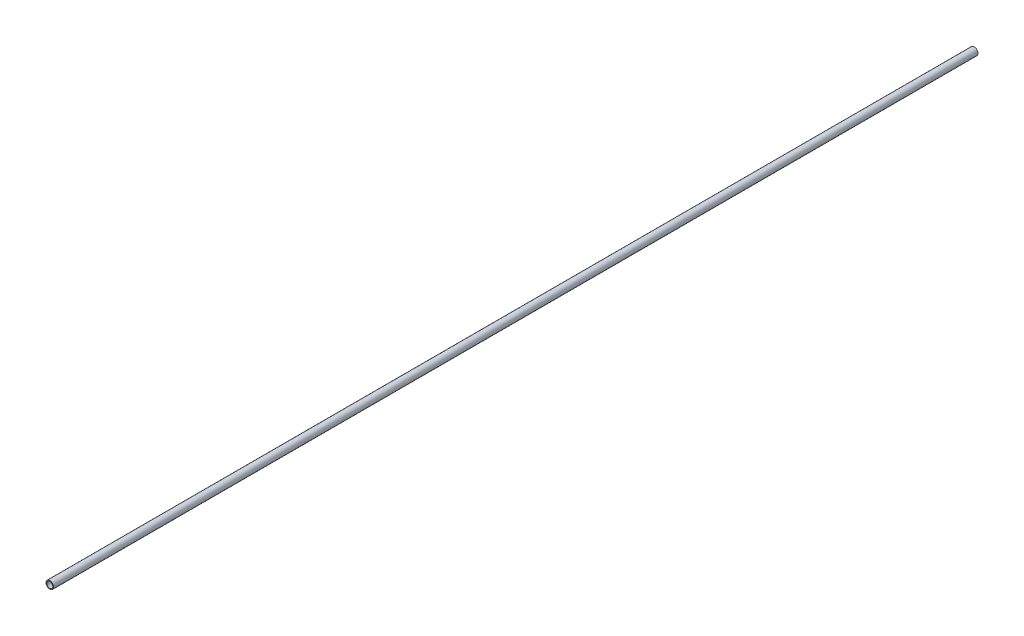
ISO-10303-21;
HEADER;
FILE_DESCRIPTION(('STEP AP214'),'2;1');
FILE_NAME('part.step','',(''),(''),'','','');
FILE_SCHEMA(('AUTOMOTIVE_DESIGN { 1 0 10303 214 1 1 1 1 }'));
ENDSEC;
DATA;
#1=APPLICATION_CONTEXT('core data for automotive mechanical design processes');
#2=APPLICATION_PROTOCOL_DEFINITION('international standard','automotive_design',2000,#1);
#3=PRODUCT_CONTEXT('',#1,'mechanical');
#4=PRODUCT('Part','Part','',(#3));
#5=PRODUCT_RELATED_PRODUCT_CATEGORY('part','',(#4));
#6=PRODUCT_DEFINITION_FORMATION('','',#4);
#7=PRODUCT_DEFINITION_CONTEXT('part definition',#1,'design');
#8=PRODUCT_DEFINITION('design','',#6,#7);
#9=PRODUCT_DEFINITION_SHAPE('','',#8);
#10=(LENGTH_UNIT() NAMED_UNIT(*) SI_UNIT(.MILLI.,.METRE.));
#11=(NAMED_UNIT(*) PLANE_ANGLE_UNIT() SI_UNIT($,.RADIAN.));
#12=(NAMED_UNIT(*) SI_UNIT($,.STERADIAN.) SOLID_ANGLE_UNIT());
#13=UNCERTAINTY_MEASURE_WITH_UNIT(LENGTH_MEASURE(1.E-05),#10,'distance_accuracy_value','');
#14=(GEOMETRIC_REPRESENTATION_CONTEXT(3) GLOBAL_UNCERTAINTY_ASSIGNED_CONTEXT((#13)) GLOBAL_UNIT_ASSIGNED_CONTEXT((#10,
#11,#12)) REPRESENTATION_CONTEXT('',''));
#15=CARTESIAN_POINT('',(0.,0.,0.));
#16=DIRECTION('',(0.,0.,1.));
#17=DIRECTION('',(1.,0.,0.));
#18=AXIS2_PLACEMENT_3D('',#15,#16,#17);
#19=CARTESIAN_POINT('',(0.,0.,610.));
#20=DIRECTION('',(0.,0.,1.));
#21=DIRECTION('',(1.,0.,0.));
#22=AXIS2_PLACEMENT_3D('',#19,#20,#21);
#23=PLANE('',#22);
#24=CARTESIAN_POINT('',(0.,0.,610.));
#25=DIRECTION('',(0.,0.,1.));
#26=DIRECTION('',(1.,0.,0.));
#27=AXIS2_PLACEMENT_3D('',#24,#25,#26);
#28=CIRCLE('',#27,2.5);
#29=CARTESIAN_POINT('',(2.5,0.,610.));
#30=VERTEX_POINT('',#29);
#31=EDGE_CURVE('E10',#30,#30,#28,.T.);
#32=ORIENTED_EDGE('',*,*,#31,.T.);
#33=EDGE_LOOP('',(#32));
#34=FACE_BOUND('',#33,.T.);
#35=CARTESIAN_POINT('',(0.,0.,610.));
#36=DIRECTION('',(0.,0.,1.));
#37=DIRECTION('',(1.,0.,0.));
#38=AXIS2_PLACEMENT_3D('',#35,#36,#37);
#39=CIRCLE('',#38,2.);
#40=CARTESIAN_POINT('',(2.,0.,610.));
#41=VERTEX_POINT('',#40);
#42=EDGE_CURVE('E50',#41,#41,#39,.T.);
#43=ORIENTED_EDGE('',*,*,#42,.F.);
#44=EDGE_LOOP('',(#43));
#45=FACE_BOUND('',#44,.T.);
#46=ADVANCED_FACE('F37',(#34,#45),#23,.T.);
#47=CARTESIAN_POINT('',(0.,0.,0.));
#48=DIRECTION('',(0.,0.,1.));
#49=DIRECTION('',(1.,0.,0.));
#50=AXIS2_PLACEMENT_3D('',#47,#48,#49);
#51=PLANE('',#50);
#52=CARTESIAN_POINT('',(0.,0.,0.));
#53=DIRECTION('',(0.,0.,1.));
#54=DIRECTION('',(1.,0.,0.));
#55=AXIS2_PLACEMENT_3D('',#52,#53,#54);
#56=CIRCLE('',#55,2.5);
#57=CARTESIAN_POINT('',(2.5,0.,0.));
#58=VERTEX_POINT('',#57);
#59=EDGE_CURVE('E41',#58,#58,#56,.T.);
#60=ORIENTED_EDGE('',*,*,#59,.F.);
#61=EDGE_LOOP('',(#60));
#62=FACE_BOUND('',#61,.T.);
#63=CARTESIAN_POINT('',(0.,0.,0.));
#64=DIRECTION('',(0.,0.,1.));
#65=DIRECTION('',(1.,0.,0.));
#66=AXIS2_PLACEMENT_3D('',#63,#64,#65);
#67=CIRCLE('',#66,2.);
#68=CARTESIAN_POINT('',(2.,0.,0.));
#69=VERTEX_POINT('',#68);
#70=EDGE_CURVE('E52',#69,#69,#67,.T.);
#71=ORIENTED_EDGE('',*,*,#70,.T.);
#72=EDGE_LOOP('',(#71));
#73=FACE_BOUND('',#72,.T.);
#74=ADVANCED_FACE('F64',(#62,#73),#51,.F.);
#75=CARTESIAN_POINT('',(0.,0.,610.));
#76=DIRECTION('',(0.,0.,-1.));
#77=DIRECTION('',(-1.,0.,0.));
#78=AXIS2_PLACEMENT_3D('',#75,#76,#77);
#79=CYLINDRICAL_SURFACE('',#78,2.5);
#80=ORIENTED_EDGE('',*,*,#31,.F.);
#81=EDGE_LOOP('',(#80));
#82=FACE_BOUND('',#81,.T.);
#83=ORIENTED_EDGE('',*,*,#59,.T.);
#84=EDGE_LOOP('',(#83));
#85=FACE_BOUND('',#84,.T.);
#86=ADVANCED_FACE('F39',(#82,#85),#79,.T.);
#87=CARTESIAN_POINT('',(0.,0.,610.));
#88=DIRECTION('',(0.,0.,-1.));
#89=DIRECTION('',(-1.,0.,0.));
#90=AXIS2_PLACEMENT_3D('',#87,#88,#89);
#91=CYLINDRICAL_SURFACE('',#90,2.);
#92=ORIENTED_EDGE('',*,*,#42,.T.);
#93=EDGE_LOOP('',(#92));
#94=FACE_BOUND('',#93,.T.);
#95=ORIENTED_EDGE('',*,*,#70,.F.);
#96=EDGE_LOOP('',(#95));
#97=FACE_BOUND('',#96,.T.);
#98=ADVANCED_FACE('F60',(#94,#97),#91,.F.);
#99=CLOSED_SHELL('',(#46,#74,#86,#98));
#100=MANIFOLD_SOLID_BREP('B2',#99);
#101=ADVANCED_BREP_SHAPE_REPRESENTATION('',(#18,#100),#14);
#102=SHAPE_DEFINITION_REPRESENTATION(#9,#101);
ENDSEC;
END-ISO-10303-21;
